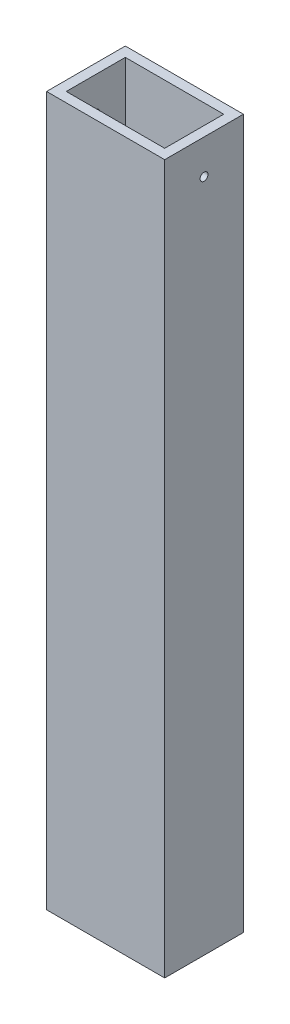
ISO-10303-21;
HEADER;
FILE_DESCRIPTION(('STEP AP214'),'2;1');
FILE_NAME('part.step','',(''),(''),'','','');
FILE_SCHEMA(('AUTOMOTIVE_DESIGN { 1 0 10303 214 1 1 1 1 }'));
ENDSEC;
DATA;
#1=APPLICATION_CONTEXT('core data for automotive mechanical design processes');
#2=APPLICATION_PROTOCOL_DEFINITION('international standard','automotive_design',2000,#1);
#3=PRODUCT_CONTEXT('',#1,'mechanical');
#4=PRODUCT('Part','Part','',(#3));
#5=PRODUCT_RELATED_PRODUCT_CATEGORY('part','',(#4));
#6=PRODUCT_DEFINITION_FORMATION('','',#4);
#7=PRODUCT_DEFINITION_CONTEXT('part definition',#1,'design');
#8=PRODUCT_DEFINITION('design','',#6,#7);
#9=PRODUCT_DEFINITION_SHAPE('','',#8);
#10=(LENGTH_UNIT() NAMED_UNIT(*) SI_UNIT(.MILLI.,.METRE.));
#11=(NAMED_UNIT(*) PLANE_ANGLE_UNIT() SI_UNIT($,.RADIAN.));
#12=(NAMED_UNIT(*) SI_UNIT($,.STERADIAN.) SOLID_ANGLE_UNIT());
#13=UNCERTAINTY_MEASURE_WITH_UNIT(LENGTH_MEASURE(1.E-05),#10,'distance_accuracy_value','');
#14=(GEOMETRIC_REPRESENTATION_CONTEXT(3) GLOBAL_UNCERTAINTY_ASSIGNED_CONTEXT((#13)) GLOBAL_UNIT_ASSIGNED_CONTEXT((#10,
#11,#12)) REPRESENTATION_CONTEXT('',''));
#15=CARTESIAN_POINT('',(0.,0.,0.));
#16=DIRECTION('',(0.,0.,1.));
#17=DIRECTION('',(1.,0.,0.));
#18=AXIS2_PLACEMENT_3D('',#15,#16,#17);
#19=CARTESIAN_POINT('',(0.,457.2,0.));
#20=DIRECTION('',(0.,-1.,0.));
#21=DIRECTION('',(0.,0.,-1.));
#22=AXIS2_PLACEMENT_3D('',#19,#20,#21);
#23=PLANE('',#22);
#24=DIRECTION('',(0.,0.,-1.));
#25=VECTOR('',#24,1.);
#26=CARTESIAN_POINT('',(38.1,457.2,25.4));
#27=LINE('',#26,#25);
#28=CARTESIAN_POINT('',(38.1,457.2,25.4));
#29=VERTEX_POINT('',#28);
#30=CARTESIAN_POINT('',(38.1,457.2,-25.4));
#31=VERTEX_POINT('',#30);
#32=EDGE_CURVE('E138',#29,#31,#27,.T.);
#33=ORIENTED_EDGE('',*,*,#32,.T.);
#34=DIRECTION('',(-1.,0.,0.));
#35=VECTOR('',#34,1.);
#36=CARTESIAN_POINT('',(-38.1,457.2,-25.4));
#37=LINE('',#36,#35);
#38=CARTESIAN_POINT('',(-38.1,457.2,-25.4));
#39=VERTEX_POINT('',#38);
#40=EDGE_CURVE('E141',#31,#39,#37,.T.);
#41=ORIENTED_EDGE('',*,*,#40,.T.);
#42=DIRECTION('',(0.,0.,1.));
#43=VECTOR('',#42,1.);
#44=CARTESIAN_POINT('',(-38.1,457.2,25.4));
#45=LINE('',#44,#43);
#46=CARTESIAN_POINT('',(-38.1,457.2,25.4));
#47=VERTEX_POINT('',#46);
#48=EDGE_CURVE('E144',#39,#47,#45,.T.);
#49=ORIENTED_EDGE('',*,*,#48,.T.);
#50=DIRECTION('',(1.,0.,0.));
#51=VECTOR('',#50,1.);
#52=CARTESIAN_POINT('',(-38.1,457.2,25.4));
#53=LINE('',#52,#51);
#54=EDGE_CURVE('E146',#47,#29,#53,.T.);
#55=ORIENTED_EDGE('',*,*,#54,.T.);
#56=EDGE_LOOP('',(#33,#41,#49,#55));
#57=FACE_BOUND('',#56,.T.);
#58=DIRECTION('',(1.,0.,0.));
#59=VECTOR('',#58,1.);
#60=CARTESIAN_POINT('',(-31.75,457.2,19.05));
#61=LINE('',#60,#59);
#62=CARTESIAN_POINT('',(-31.75,457.2,19.05));
#63=VERTEX_POINT('',#62);
#64=CARTESIAN_POINT('',(31.75,457.2,19.05));
#65=VERTEX_POINT('',#64);
#66=EDGE_CURVE('E100',#63,#65,#61,.T.);
#67=ORIENTED_EDGE('',*,*,#66,.F.);
#68=DIRECTION('',(0.,0.,1.));
#69=VECTOR('',#68,1.);
#70=CARTESIAN_POINT('',(-31.75,457.2,19.05));
#71=LINE('',#70,#69);
#72=CARTESIAN_POINT('',(-31.75,457.2,-19.05));
#73=VERTEX_POINT('',#72);
#74=EDGE_CURVE('E122',#73,#63,#71,.T.);
#75=ORIENTED_EDGE('',*,*,#74,.F.);
#76=DIRECTION('',(-1.,0.,0.));
#77=VECTOR('',#76,1.);
#78=CARTESIAN_POINT('',(-31.75,457.2,-19.05));
#79=LINE('',#78,#77);
#80=CARTESIAN_POINT('',(31.75,457.2,-19.05));
#81=VERTEX_POINT('',#80);
#82=EDGE_CURVE('E120',#81,#73,#79,.T.);
#83=ORIENTED_EDGE('',*,*,#82,.F.);
#84=DIRECTION('',(0.,0.,-1.));
#85=VECTOR('',#84,1.);
#86=CARTESIAN_POINT('',(31.75,457.2,19.05));
#87=LINE('',#86,#85);
#88=EDGE_CURVE('E108',#65,#81,#87,.T.);
#89=ORIENTED_EDGE('',*,*,#88,.F.);
#90=EDGE_LOOP('',(#67,#75,#83,#89));
#91=FACE_BOUND('',#90,.T.);
#92=ADVANCED_FACE('F34',(#57,#91),#23,.F.);
#93=CARTESIAN_POINT('',(0.,0.,0.));
#94=DIRECTION('',(0.,-1.,0.));
#95=DIRECTION('',(0.,0.,-1.));
#96=AXIS2_PLACEMENT_3D('',#93,#94,#95);
#97=PLANE('',#96);
#98=DIRECTION('',(0.,0.,-1.));
#99=VECTOR('',#98,1.);
#100=CARTESIAN_POINT('',(38.1,0.,25.4));
#101=LINE('',#100,#99);
#102=CARTESIAN_POINT('',(38.1,0.,25.4));
#103=VERTEX_POINT('',#102);
#104=CARTESIAN_POINT('',(38.1,0.,-25.4));
#105=VERTEX_POINT('',#104);
#106=EDGE_CURVE('E116',#103,#105,#101,.T.);
#107=ORIENTED_EDGE('',*,*,#106,.F.);
#108=DIRECTION('',(1.,0.,0.));
#109=VECTOR('',#108,1.);
#110=CARTESIAN_POINT('',(-38.1,0.,25.4));
#111=LINE('',#110,#109);
#112=CARTESIAN_POINT('',(-38.1,0.,25.4));
#113=VERTEX_POINT('',#112);
#114=EDGE_CURVE('E142',#113,#103,#111,.T.);
#115=ORIENTED_EDGE('',*,*,#114,.F.);
#116=DIRECTION('',(0.,0.,1.));
#117=VECTOR('',#116,1.);
#118=CARTESIAN_POINT('',(-38.1,0.,25.4));
#119=LINE('',#118,#117);
#120=CARTESIAN_POINT('',(-38.1,0.,-25.4));
#121=VERTEX_POINT('',#120);
#122=EDGE_CURVE('E153',#121,#113,#119,.T.);
#123=ORIENTED_EDGE('',*,*,#122,.F.);
#124=DIRECTION('',(-1.,0.,0.));
#125=VECTOR('',#124,1.);
#126=CARTESIAN_POINT('',(-38.1,0.,-25.4));
#127=LINE('',#126,#125);
#128=EDGE_CURVE('E151',#105,#121,#127,.T.);
#129=ORIENTED_EDGE('',*,*,#128,.F.);
#130=EDGE_LOOP('',(#107,#115,#123,#129));
#131=FACE_BOUND('',#130,.T.);
#132=DIRECTION('',(0.,0.,1.));
#133=VECTOR('',#132,1.);
#134=CARTESIAN_POINT('',(-31.75,0.,19.05));
#135=LINE('',#134,#133);
#136=CARTESIAN_POINT('',(-31.75,0.,-19.05));
#137=VERTEX_POINT('',#136);
#138=CARTESIAN_POINT('',(-31.75,0.,19.05));
#139=VERTEX_POINT('',#138);
#140=EDGE_CURVE('E109',#137,#139,#135,.T.);
#141=ORIENTED_EDGE('',*,*,#140,.T.);
#142=DIRECTION('',(1.,0.,0.));
#143=VECTOR('',#142,1.);
#144=CARTESIAN_POINT('',(-31.75,0.,19.05));
#145=LINE('',#144,#143);
#146=CARTESIAN_POINT('',(31.75,0.,19.05));
#147=VERTEX_POINT('',#146);
#148=EDGE_CURVE('E58',#139,#147,#145,.T.);
#149=ORIENTED_EDGE('',*,*,#148,.T.);
#150=DIRECTION('',(0.,0.,-1.));
#151=VECTOR('',#150,1.);
#152=CARTESIAN_POINT('',(31.75,0.,19.05));
#153=LINE('',#152,#151);
#154=CARTESIAN_POINT('',(31.75,0.,-19.05));
#155=VERTEX_POINT('',#154);
#156=EDGE_CURVE('E115',#147,#155,#153,.T.);
#157=ORIENTED_EDGE('',*,*,#156,.T.);
#158=DIRECTION('',(-1.,0.,0.));
#159=VECTOR('',#158,1.);
#160=CARTESIAN_POINT('',(-31.75,0.,-19.05));
#161=LINE('',#160,#159);
#162=EDGE_CURVE('E130',#155,#137,#161,.T.);
#163=ORIENTED_EDGE('',*,*,#162,.T.);
#164=EDGE_LOOP('',(#141,#149,#157,#163));
#165=FACE_BOUND('',#164,.T.);
#166=ADVANCED_FACE('F172',(#131,#165),#97,.T.);
#167=CARTESIAN_POINT('',(38.1,457.2,25.4));
#168=DIRECTION('',(-1.,0.,0.));
#169=DIRECTION('',(0.,0.,1.));
#170=AXIS2_PLACEMENT_3D('',#167,#168,#169);
#171=PLANE('',#170);
#172=CARTESIAN_POINT('',(38.1,434.975,0.));
#173=DIRECTION('',(-1.,0.,0.));
#174=DIRECTION('',(0.,0.,1.));
#175=AXIS2_PLACEMENT_3D('',#172,#173,#174);
#176=CIRCLE('',#175,2.55269999999996);
#177=CARTESIAN_POINT('',(38.1,434.975,2.55269999999997));
#178=VERTEX_POINT('',#177);
#179=EDGE_CURVE('E234',#178,#178,#176,.T.);
#180=ORIENTED_EDGE('',*,*,#179,.T.);
#181=EDGE_LOOP('',(#180));
#182=FACE_BOUND('',#181,.T.);
#183=ORIENTED_EDGE('',*,*,#106,.T.);
#184=DIRECTION('',(0.,-1.,0.));
#185=VECTOR('',#184,1.);
#186=CARTESIAN_POINT('',(38.1,457.2,-25.4));
#187=LINE('',#186,#185);
#188=EDGE_CURVE('E11',#31,#105,#187,.T.);
#189=ORIENTED_EDGE('',*,*,#188,.F.);
#190=ORIENTED_EDGE('',*,*,#32,.F.);
#191=DIRECTION('',(0.,-1.,0.));
#192=VECTOR('',#191,1.);
#193=CARTESIAN_POINT('',(38.1,457.2,25.4));
#194=LINE('',#193,#192);
#195=EDGE_CURVE('E148',#29,#103,#194,.T.);
#196=ORIENTED_EDGE('',*,*,#195,.T.);
#197=EDGE_LOOP('',(#183,#189,#190,#196));
#198=FACE_BOUND('',#197,.T.);
#199=ADVANCED_FACE('F36',(#182,#198),#171,.F.);
#200=CARTESIAN_POINT('',(-38.1,457.2,-25.4));
#201=DIRECTION('',(0.,0.,1.));
#202=DIRECTION('',(1.,0.,0.));
#203=AXIS2_PLACEMENT_3D('',#200,#201,#202);
#204=PLANE('',#203);
#205=ORIENTED_EDGE('',*,*,#128,.T.);
#206=DIRECTION('',(0.,-1.,0.));
#207=VECTOR('',#206,1.);
#208=CARTESIAN_POINT('',(-38.1,457.2,-25.4));
#209=LINE('',#208,#207);
#210=EDGE_CURVE('E43',#39,#121,#209,.T.);
#211=ORIENTED_EDGE('',*,*,#210,.F.);
#212=ORIENTED_EDGE('',*,*,#40,.F.);
#213=ORIENTED_EDGE('',*,*,#188,.T.);
#214=EDGE_LOOP('',(#205,#211,#212,#213));
#215=FACE_BOUND('',#214,.T.);
#216=ADVANCED_FACE('F182',(#215),#204,.F.);
#217=CARTESIAN_POINT('',(-38.1,457.2,25.4));
#218=DIRECTION('',(1.,0.,0.));
#219=DIRECTION('',(0.,0.,-1.));
#220=AXIS2_PLACEMENT_3D('',#217,#218,#219);
#221=PLANE('',#220);
#222=CARTESIAN_POINT('',(-38.1,434.975,0.));
#223=DIRECTION('',(-1.,0.,0.));
#224=DIRECTION('',(0.,0.,1.));
#225=AXIS2_PLACEMENT_3D('',#222,#223,#224);
#226=CIRCLE('',#225,2.55270000000002);
#227=CARTESIAN_POINT('',(-38.1,434.975,2.55270000000002));
#228=VERTEX_POINT('',#227);
#229=EDGE_CURVE('E233',#228,#228,#226,.T.);
#230=ORIENTED_EDGE('',*,*,#229,.F.);
#231=EDGE_LOOP('',(#230));
#232=FACE_BOUND('',#231,.T.);
#233=ORIENTED_EDGE('',*,*,#122,.T.);
#234=DIRECTION('',(0.,-1.,0.));
#235=VECTOR('',#234,1.);
#236=CARTESIAN_POINT('',(-38.1,457.2,25.4));
#237=LINE('',#236,#235);
#238=EDGE_CURVE('E158',#47,#113,#237,.T.);
#239=ORIENTED_EDGE('',*,*,#238,.F.);
#240=ORIENTED_EDGE('',*,*,#48,.F.);
#241=ORIENTED_EDGE('',*,*,#210,.T.);
#242=EDGE_LOOP('',(#233,#239,#240,#241));
#243=FACE_BOUND('',#242,.T.);
#244=ADVANCED_FACE('F166',(#232,#243),#221,.F.);
#245=CARTESIAN_POINT('',(-38.1,457.2,25.4));
#246=DIRECTION('',(0.,0.,-1.));
#247=DIRECTION('',(-1.,0.,0.));
#248=AXIS2_PLACEMENT_3D('',#245,#246,#247);
#249=PLANE('',#248);
#250=ORIENTED_EDGE('',*,*,#114,.T.);
#251=ORIENTED_EDGE('',*,*,#195,.F.);
#252=ORIENTED_EDGE('',*,*,#54,.F.);
#253=ORIENTED_EDGE('',*,*,#238,.T.);
#254=EDGE_LOOP('',(#250,#251,#252,#253));
#255=FACE_BOUND('',#254,.T.);
#256=ADVANCED_FACE('F176',(#255),#249,.F.);
#257=CARTESIAN_POINT('',(-31.75,457.2,19.05));
#258=DIRECTION('',(0.,0.,-1.));
#259=DIRECTION('',(-1.,0.,0.));
#260=AXIS2_PLACEMENT_3D('',#257,#258,#259);
#261=PLANE('',#260);
#262=ORIENTED_EDGE('',*,*,#148,.F.);
#263=DIRECTION('',(0.,-1.,0.));
#264=VECTOR('',#263,1.);
#265=CARTESIAN_POINT('',(-31.75,457.2,19.05));
#266=LINE('',#265,#264);
#267=EDGE_CURVE('E104',#63,#139,#266,.T.);
#268=ORIENTED_EDGE('',*,*,#267,.F.);
#269=ORIENTED_EDGE('',*,*,#66,.T.);
#270=DIRECTION('',(0.,-1.,0.));
#271=VECTOR('',#270,1.);
#272=CARTESIAN_POINT('',(31.75,457.2,19.05));
#273=LINE('',#272,#271);
#274=EDGE_CURVE('E103',#65,#147,#273,.T.);
#275=ORIENTED_EDGE('',*,*,#274,.T.);
#276=EDGE_LOOP('',(#262,#268,#269,#275));
#277=FACE_BOUND('',#276,.T.);
#278=ADVANCED_FACE('F102',(#277),#261,.T.);
#279=CARTESIAN_POINT('',(31.75,457.2,19.05));
#280=DIRECTION('',(-1.,0.,0.));
#281=DIRECTION('',(0.,0.,1.));
#282=AXIS2_PLACEMENT_3D('',#279,#280,#281);
#283=PLANE('',#282);
#284=CARTESIAN_POINT('',(31.75,434.975,0.));
#285=DIRECTION('',(-1.,0.,0.));
#286=DIRECTION('',(0.,0.,1.));
#287=AXIS2_PLACEMENT_3D('',#284,#285,#286);
#288=CIRCLE('',#287,2.55269999999999);
#289=CARTESIAN_POINT('',(31.75,434.975,2.55269999999999));
#290=VERTEX_POINT('',#289);
#291=EDGE_CURVE('E128',#290,#290,#288,.T.);
#292=ORIENTED_EDGE('',*,*,#291,.F.);
#293=EDGE_LOOP('',(#292));
#294=FACE_BOUND('',#293,.T.);
#295=ORIENTED_EDGE('',*,*,#156,.F.);
#296=ORIENTED_EDGE('',*,*,#274,.F.);
#297=ORIENTED_EDGE('',*,*,#88,.T.);
#298=DIRECTION('',(0.,-1.,0.));
#299=VECTOR('',#298,1.);
#300=CARTESIAN_POINT('',(31.75,457.2,-19.05));
#301=LINE('',#300,#299);
#302=EDGE_CURVE('E117',#81,#155,#301,.T.);
#303=ORIENTED_EDGE('',*,*,#302,.T.);
#304=EDGE_LOOP('',(#295,#296,#297,#303));
#305=FACE_BOUND('',#304,.T.);
#306=ADVANCED_FACE('F112',(#294,#305),#283,.T.);
#307=CARTESIAN_POINT('',(-31.75,457.2,-19.05));
#308=DIRECTION('',(0.,0.,1.));
#309=DIRECTION('',(1.,0.,0.));
#310=AXIS2_PLACEMENT_3D('',#307,#308,#309);
#311=PLANE('',#310);
#312=ORIENTED_EDGE('',*,*,#162,.F.);
#313=ORIENTED_EDGE('',*,*,#302,.F.);
#314=ORIENTED_EDGE('',*,*,#82,.T.);
#315=DIRECTION('',(0.,-1.,0.));
#316=VECTOR('',#315,1.);
#317=CARTESIAN_POINT('',(-31.75,457.2,-19.05));
#318=LINE('',#317,#316);
#319=EDGE_CURVE('E50',#73,#137,#318,.T.);
#320=ORIENTED_EDGE('',*,*,#319,.T.);
#321=EDGE_LOOP('',(#312,#313,#314,#320));
#322=FACE_BOUND('',#321,.T.);
#323=ADVANCED_FACE('F207',(#322),#311,.T.);
#324=CARTESIAN_POINT('',(-31.75,457.2,19.05));
#325=DIRECTION('',(1.,0.,0.));
#326=DIRECTION('',(0.,0.,-1.));
#327=AXIS2_PLACEMENT_3D('',#324,#325,#326);
#328=PLANE('',#327);
#329=CARTESIAN_POINT('',(-31.75,434.975,0.));
#330=DIRECTION('',(1.,0.,0.));
#331=DIRECTION('',(0.,0.,-1.));
#332=AXIS2_PLACEMENT_3D('',#329,#330,#331);
#333=CIRCLE('',#332,2.55269999999999);
#334=CARTESIAN_POINT('',(-31.75,434.975,-2.55269999999999));
#335=VERTEX_POINT('',#334);
#336=EDGE_CURVE('E38',#335,#335,#333,.T.);
#337=ORIENTED_EDGE('',*,*,#336,.F.);
#338=EDGE_LOOP('',(#337));
#339=FACE_BOUND('',#338,.T.);
#340=ORIENTED_EDGE('',*,*,#140,.F.);
#341=ORIENTED_EDGE('',*,*,#319,.F.);
#342=ORIENTED_EDGE('',*,*,#74,.T.);
#343=ORIENTED_EDGE('',*,*,#267,.T.);
#344=EDGE_LOOP('',(#340,#341,#342,#343));
#345=FACE_BOUND('',#344,.T.);
#346=ADVANCED_FACE('F212',(#339,#345),#328,.T.);
#347=CARTESIAN_POINT('',(-38.1,434.975,0.));
#348=DIRECTION('',(-1.,0.,0.));
#349=DIRECTION('',(0.,0.,1.));
#350=AXIS2_PLACEMENT_3D('',#347,#348,#349);
#351=CYLINDRICAL_SURFACE('',#350,2.55269999999999);
#352=ORIENTED_EDGE('',*,*,#336,.T.);
#353=EDGE_LOOP('',(#352));
#354=FACE_BOUND('',#353,.T.);
#355=ORIENTED_EDGE('',*,*,#229,.T.);
#356=EDGE_LOOP('',(#355));
#357=FACE_BOUND('',#356,.T.);
#358=ADVANCED_FACE('F219',(#354,#357),#351,.F.);
#359=ORIENTED_EDGE('',*,*,#291,.T.);
#360=EDGE_LOOP('',(#359));
#361=FACE_BOUND('',#360,.T.);
#362=ORIENTED_EDGE('',*,*,#179,.F.);
#363=EDGE_LOOP('',(#362));
#364=FACE_BOUND('',#363,.T.);
#365=ADVANCED_FACE('F222',(#361,#364),#351,.F.);
#366=CLOSED_SHELL('',(#92,#166,#199,#216,#244,#256,#278,#306,#323,#346,#358,#365));
#367=MANIFOLD_SOLID_BREP('B2',#366);
#368=ADVANCED_BREP_SHAPE_REPRESENTATION('',(#18,#367),#14);
#369=SHAPE_DEFINITION_REPRESENTATION(#9,#368);
ENDSEC;
END-ISO-10303-21;
